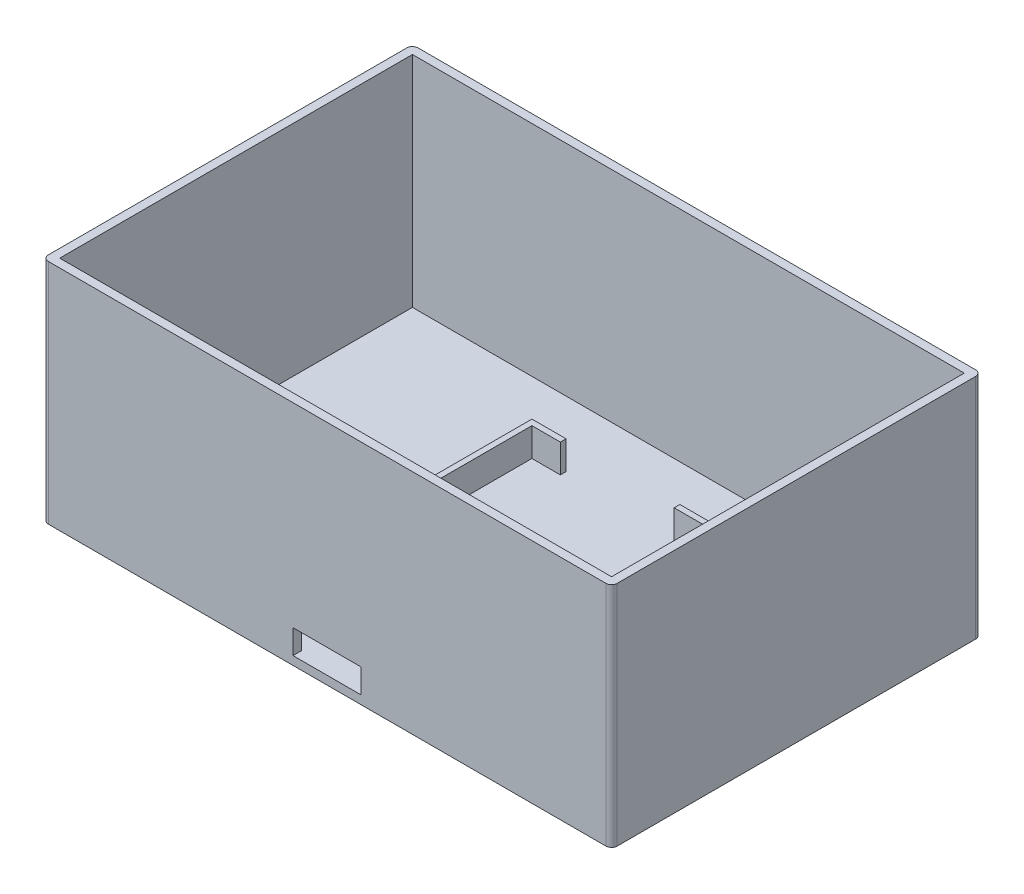
ISO-10303-21;
HEADER;
FILE_DESCRIPTION(('STEP AP214'),'2;1');
FILE_NAME('part.step','',(''),(''),'','','');
FILE_SCHEMA(('AUTOMOTIVE_DESIGN { 1 0 10303 214 1 1 1 1 }'));
ENDSEC;
DATA;
#1=APPLICATION_CONTEXT('core data for automotive mechanical design processes');
#2=APPLICATION_PROTOCOL_DEFINITION('international standard','automotive_design',2000,#1);
#3=PRODUCT_CONTEXT('',#1,'mechanical');
#4=PRODUCT('Part','Part','',(#3));
#5=PRODUCT_RELATED_PRODUCT_CATEGORY('part','',(#4));
#6=PRODUCT_DEFINITION_FORMATION('','',#4);
#7=PRODUCT_DEFINITION_CONTEXT('part definition',#1,'design');
#8=PRODUCT_DEFINITION('design','',#6,#7);
#9=PRODUCT_DEFINITION_SHAPE('','',#8);
#10=(LENGTH_UNIT() NAMED_UNIT(*) SI_UNIT(.MILLI.,.METRE.));
#11=(NAMED_UNIT(*) PLANE_ANGLE_UNIT() SI_UNIT($,.RADIAN.));
#12=(NAMED_UNIT(*) SI_UNIT($,.STERADIAN.) SOLID_ANGLE_UNIT());
#13=UNCERTAINTY_MEASURE_WITH_UNIT(LENGTH_MEASURE(1.E-05),#10,'distance_accuracy_value','');
#14=(GEOMETRIC_REPRESENTATION_CONTEXT(3) GLOBAL_UNCERTAINTY_ASSIGNED_CONTEXT((#13)) GLOBAL_UNIT_ASSIGNED_CONTEXT((#10,
#11,#12)) REPRESENTATION_CONTEXT('',''));
#15=CARTESIAN_POINT('',(0.,0.,0.));
#16=DIRECTION('',(0.,0.,1.));
#17=DIRECTION('',(1.,0.,0.));
#18=AXIS2_PLACEMENT_3D('',#15,#16,#17);
#19=CARTESIAN_POINT('',(-13.7604562737643,6.5,-28.8555133079848));
#20=DIRECTION('',(0.,0.,1.));
#21=DIRECTION('',(1.,0.,0.));
#22=AXIS2_PLACEMENT_3D('',#19,#20,#21);
#23=PLANE('',#22);
#24=DIRECTION('',(0.,1.,0.));
#25=VECTOR('',#24,1.);
#26=CARTESIAN_POINT('',(-8.76045627376426,1.5,-28.8555133079848));
#27=LINE('',#26,#25);
#28=CARTESIAN_POINT('',(-8.76045627376426,1.5,-28.8555133079848));
#29=VERTEX_POINT('',#28);
#30=CARTESIAN_POINT('',(-8.76045627376426,6.5,-28.8555133079848));
#31=VERTEX_POINT('',#30);
#32=EDGE_CURVE('E348',#29,#31,#27,.T.);
#33=ORIENTED_EDGE('',*,*,#32,.T.);
#34=DIRECTION('',(-1.,0.,0.));
#35=VECTOR('',#34,1.);
#36=CARTESIAN_POINT('',(-13.7604562737643,6.5,-28.8555133079848));
#37=LINE('',#36,#35);
#38=CARTESIAN_POINT('',(-13.7604562737643,6.5,-28.8555133079848));
#39=VERTEX_POINT('',#38);
#40=EDGE_CURVE('E342',#31,#39,#37,.T.);
#41=ORIENTED_EDGE('',*,*,#40,.T.);
#42=DIRECTION('',(0.,-1.,0.));
#43=VECTOR('',#42,1.);
#44=CARTESIAN_POINT('',(-13.7604562737643,6.5,-28.8555133079848));
#45=LINE('',#44,#43);
#46=CARTESIAN_POINT('',(-13.7604562737643,1.5,-28.8555133079848));
#47=VERTEX_POINT('',#46);
#48=EDGE_CURVE('E327',#39,#47,#45,.T.);
#49=ORIENTED_EDGE('',*,*,#48,.T.);
#50=DIRECTION('',(-1.,0.,0.));
#51=VECTOR('',#50,1.);
#52=CARTESIAN_POINT('',(-13.7604562737643,1.5,-28.8555133079848));
#53=LINE('',#52,#51);
#54=EDGE_CURVE('E335',#29,#47,#53,.T.);
#55=ORIENTED_EDGE('',*,*,#54,.F.);
#56=EDGE_LOOP('',(#33,#41,#49,#55));
#57=FACE_BOUND('',#56,.T.);
#58=ADVANCED_FACE('F57',(#57),#23,.T.);
#59=CARTESIAN_POINT('',(-13.7604562737643,6.5,-29.8555133079848));
#60=DIRECTION('',(0.,0.,1.));
#61=DIRECTION('',(1.,0.,0.));
#62=AXIS2_PLACEMENT_3D('',#59,#60,#61);
#63=PLANE('',#62);
#64=DIRECTION('',(-1.,0.,0.));
#65=VECTOR('',#64,1.);
#66=CARTESIAN_POINT('',(-13.7604562737643,6.5,-29.8555133079848));
#67=LINE('',#66,#65);
#68=CARTESIAN_POINT('',(-8.76045627376426,6.5,-29.8555133079848));
#69=VERTEX_POINT('',#68);
#70=CARTESIAN_POINT('',(-14.7604562737643,6.5,-29.8555133079848));
#71=VERTEX_POINT('',#70);
#72=EDGE_CURVE('E315',#69,#71,#67,.T.);
#73=ORIENTED_EDGE('',*,*,#72,.F.);
#74=DIRECTION('',(0.,1.,0.));
#75=VECTOR('',#74,1.);
#76=CARTESIAN_POINT('',(-8.76045627376426,1.5,-29.8555133079848));
#77=LINE('',#76,#75);
#78=CARTESIAN_POINT('',(-8.76045627376426,1.5,-29.8555133079848));
#79=VERTEX_POINT('',#78);
#80=EDGE_CURVE('E339',#79,#69,#77,.T.);
#81=ORIENTED_EDGE('',*,*,#80,.F.);
#82=DIRECTION('',(-1.,0.,0.));
#83=VECTOR('',#82,1.);
#84=CARTESIAN_POINT('',(-13.7604562737643,1.5,-29.8555133079848));
#85=LINE('',#84,#83);
#86=CARTESIAN_POINT('',(-14.7604562737643,1.5,-29.8555133079848));
#87=VERTEX_POINT('',#86);
#88=EDGE_CURVE('E308',#79,#87,#85,.T.);
#89=ORIENTED_EDGE('',*,*,#88,.T.);
#90=DIRECTION('',(0.,-1.,0.));
#91=VECTOR('',#90,1.);
#92=CARTESIAN_POINT('',(-14.7604562737643,6.5,-29.8555133079848));
#93=LINE('',#92,#91);
#94=EDGE_CURVE('E300',#71,#87,#93,.T.);
#95=ORIENTED_EDGE('',*,*,#94,.F.);
#96=EDGE_LOOP('',(#73,#81,#89,#95));
#97=FACE_BOUND('',#96,.T.);
#98=ADVANCED_FACE('F533',(#97),#63,.F.);
#99=CARTESIAN_POINT('',(0.,6.5,0.));
#100=DIRECTION('',(0.,1.,0.));
#101=DIRECTION('',(0.,0.,1.));
#102=AXIS2_PLACEMENT_3D('',#99,#100,#101);
#103=PLANE('',#102);
#104=DIRECTION('',(0.,0.,1.));
#105=VECTOR('',#104,1.);
#106=CARTESIAN_POINT('',(-8.76045627376426,6.5,-29.8555133079848));
#107=LINE('',#106,#105);
#108=EDGE_CURVE('E361',#69,#31,#107,.T.);
#109=ORIENTED_EDGE('',*,*,#108,.F.);
#110=ORIENTED_EDGE('',*,*,#72,.T.);
#111=DIRECTION('',(0.,0.,1.));
#112=VECTOR('',#111,1.);
#113=CARTESIAN_POINT('',(-14.7604562737643,6.5,-28.8555133079848));
#114=LINE('',#113,#112);
#115=CARTESIAN_POINT('',(-14.7604562737643,6.5,20.6444866920152));
#116=VERTEX_POINT('',#115);
#117=EDGE_CURVE('E307',#71,#116,#114,.T.);
#118=ORIENTED_EDGE('',*,*,#117,.T.);
#119=DIRECTION('',(-1.,0.,0.));
#120=VECTOR('',#119,1.);
#121=CARTESIAN_POINT('',(-47.2604562737643,6.5,20.6444866920152));
#122=LINE('',#121,#120);
#123=CARTESIAN_POINT('',(-13.7604562737643,6.5,20.6444866920152));
#124=VERTEX_POINT('',#123);
#125=EDGE_CURVE('E289',#124,#116,#122,.T.);
#126=ORIENTED_EDGE('',*,*,#125,.F.);
#127=DIRECTION('',(0.,0.,1.));
#128=VECTOR('',#127,1.);
#129=CARTESIAN_POINT('',(-13.7604562737643,6.5,-28.8555133079848));
#130=LINE('',#129,#128);
#131=EDGE_CURVE('E334',#39,#124,#130,.T.);
#132=ORIENTED_EDGE('',*,*,#131,.F.);
#133=ORIENTED_EDGE('',*,*,#40,.F.);
#134=EDGE_LOOP('',(#109,#110,#118,#126,#132,#133));
#135=FACE_BOUND('',#134,.T.);
#136=ADVANCED_FACE('F539',(#135),#103,.T.);
#137=CARTESIAN_POINT('',(-47.2604562737643,1.5,20.6444866920152));
#138=DIRECTION('',(0.,0.,1.));
#139=DIRECTION('',(1.,0.,0.));
#140=AXIS2_PLACEMENT_3D('',#137,#138,#139);
#141=PLANE('',#140);
#142=DIRECTION('',(1.,0.,0.));
#143=VECTOR('',#142,1.);
#144=CARTESIAN_POINT('',(-4.76045627376426,5.75,20.6444866920152));
#145=LINE('',#144,#143);
#146=CARTESIAN_POINT('',(-4.76045627376426,5.75,20.6444866920152));
#147=VERTEX_POINT('',#146);
#148=CARTESIAN_POINT('',(7.23954372623574,5.75,20.6444866920152));
#149=VERTEX_POINT('',#148);
#150=EDGE_CURVE('E244',#147,#149,#145,.T.);
#151=ORIENTED_EDGE('',*,*,#150,.F.);
#152=DIRECTION('',(0.,-1.,0.));
#153=VECTOR('',#152,1.);
#154=CARTESIAN_POINT('',(-4.76045627376426,1.5,20.6444866920152));
#155=LINE('',#154,#153);
#156=CARTESIAN_POINT('',(-4.76045627376426,1.5,20.6444866920152));
#157=VERTEX_POINT('',#156);
#158=EDGE_CURVE('E77',#147,#157,#155,.T.);
#159=ORIENTED_EDGE('',*,*,#158,.T.);
#160=DIRECTION('',(1.,0.,0.));
#161=VECTOR('',#160,1.);
#162=CARTESIAN_POINT('',(-47.2604562737643,1.5,20.6444866920152));
#163=LINE('',#162,#161);
#164=CARTESIAN_POINT('',(-13.7604562737643,1.5,20.6444866920152));
#165=VERTEX_POINT('',#164);
#166=EDGE_CURVE('E240',#165,#157,#163,.T.);
#167=ORIENTED_EDGE('',*,*,#166,.F.);
#168=DIRECTION('',(0.,-1.,0.));
#169=VECTOR('',#168,1.);
#170=CARTESIAN_POINT('',(-13.7604562737643,6.5,20.6444866920152));
#171=LINE('',#170,#169);
#172=EDGE_CURVE('E312',#124,#165,#171,.T.);
#173=ORIENTED_EDGE('',*,*,#172,.F.);
#174=ORIENTED_EDGE('',*,*,#125,.T.);
#175=DIRECTION('',(0.,1.,0.));
#176=VECTOR('',#175,1.);
#177=CARTESIAN_POINT('',(-14.7604562737643,1.5,20.6444866920152));
#178=LINE('',#177,#176);
#179=CARTESIAN_POINT('',(-14.7604562737643,1.5,20.6444866920152));
#180=VERTEX_POINT('',#179);
#181=EDGE_CURVE('E291',#180,#116,#178,.T.);
#182=ORIENTED_EDGE('',*,*,#181,.F.);
#183=CARTESIAN_POINT('',(-47.2604562737643,1.5,20.6444866920152));
#184=VERTEX_POINT('',#183);
#185=EDGE_CURVE('E262',#184,#180,#163,.T.);
#186=ORIENTED_EDGE('',*,*,#185,.F.);
#187=DIRECTION('',(0.,1.,0.));
#188=VECTOR('',#187,1.);
#189=CARTESIAN_POINT('',(-47.2604562737643,1.5,20.6444866920152));
#190=LINE('',#189,#188);
#191=CARTESIAN_POINT('',(-47.2604562737643,40.,20.6444866920152));
#192=VERTEX_POINT('',#191);
#193=EDGE_CURVE('E418',#184,#192,#190,.T.);
#194=ORIENTED_EDGE('',*,*,#193,.T.);
#195=DIRECTION('',(1.,0.,0.));
#196=VECTOR('',#195,1.);
#197=CARTESIAN_POINT('',(-47.2604562737643,40.,20.6444866920152));
#198=LINE('',#197,#196);
#199=CARTESIAN_POINT('',(49.7395437262358,40.,20.6444866920152));
#200=VERTEX_POINT('',#199);
#201=EDGE_CURVE('E413',#192,#200,#198,.T.);
#202=ORIENTED_EDGE('',*,*,#201,.T.);
#203=DIRECTION('',(0.,1.,0.));
#204=VECTOR('',#203,1.);
#205=CARTESIAN_POINT('',(49.7395437262358,1.5,20.6444866920152));
#206=LINE('',#205,#204);
#207=CARTESIAN_POINT('',(49.7395437262358,1.5,20.6444866920152));
#208=VERTEX_POINT('',#207);
#209=EDGE_CURVE('E409',#208,#200,#206,.T.);
#210=ORIENTED_EDGE('',*,*,#209,.F.);
#211=CARTESIAN_POINT('',(17.2395437262358,1.5,20.6444866920152));
#212=VERTEX_POINT('',#211);
#213=EDGE_CURVE('E265',#212,#208,#163,.T.);
#214=ORIENTED_EDGE('',*,*,#213,.F.);
#215=DIRECTION('',(0.,-1.,0.));
#216=VECTOR('',#215,1.);
#217=CARTESIAN_POINT('',(17.2395437262358,1.5,20.6444866920152));
#218=LINE('',#217,#216);
#219=CARTESIAN_POINT('',(17.2395437262358,6.5,20.6444866920152));
#220=VERTEX_POINT('',#219);
#221=EDGE_CURVE('E294',#220,#212,#218,.T.);
#222=ORIENTED_EDGE('',*,*,#221,.F.);
#223=CARTESIAN_POINT('',(16.2395437262358,6.5,20.6444866920152));
#224=VERTEX_POINT('',#223);
#225=EDGE_CURVE('E288',#220,#224,#122,.T.);
#226=ORIENTED_EDGE('',*,*,#225,.T.);
#227=DIRECTION('',(0.,-1.,0.));
#228=VECTOR('',#227,1.);
#229=CARTESIAN_POINT('',(16.2395437262358,6.5,20.6444866920152));
#230=LINE('',#229,#228);
#231=CARTESIAN_POINT('',(16.2395437262358,1.5,20.6444866920152));
#232=VERTEX_POINT('',#231);
#233=EDGE_CURVE('E321',#224,#232,#230,.T.);
#234=ORIENTED_EDGE('',*,*,#233,.T.);
#235=CARTESIAN_POINT('',(7.23954372623574,1.5,20.6444866920152));
#236=VERTEX_POINT('',#235);
#237=EDGE_CURVE('E263',#236,#232,#163,.T.);
#238=ORIENTED_EDGE('',*,*,#237,.F.);
#239=DIRECTION('',(0.,1.,0.));
#240=VECTOR('',#239,1.);
#241=CARTESIAN_POINT('',(7.23954372623574,1.5,20.6444866920152));
#242=LINE('',#241,#240);
#243=EDGE_CURVE('E246',#236,#149,#242,.T.);
#244=ORIENTED_EDGE('',*,*,#243,.T.);
#245=EDGE_LOOP('',(#151,#159,#167,#173,#174,#182,#186,#194,#202,#210,#214,#222,#226,#234,#238,#244));
#246=FACE_BOUND('',#245,.T.);
#247=ADVANCED_FACE('F238',(#246),#141,.F.);
#248=CARTESIAN_POINT('',(0.,40.,0.));
#249=DIRECTION('',(0.,1.,0.));
#250=DIRECTION('',(0.,0.,1.));
#251=AXIS2_PLACEMENT_3D('',#248,#249,#250);
#252=PLANE('',#251);
#253=DIRECTION('',(0.,0.,1.));
#254=VECTOR('',#253,1.);
#255=CARTESIAN_POINT('',(-47.2604562737643,40.,-41.3555133079848));
#256=LINE('',#255,#254);
#257=CARTESIAN_POINT('',(-47.2604562737643,40.,-41.3555133079848));
#258=VERTEX_POINT('',#257);
#259=EDGE_CURVE('E284',#258,#192,#256,.T.);
#260=ORIENTED_EDGE('',*,*,#259,.F.);
#261=DIRECTION('',(-1.,0.,0.));
#262=VECTOR('',#261,1.);
#263=CARTESIAN_POINT('',(-47.2604562737643,40.,-41.3555133079848));
#264=LINE('',#263,#262);
#265=CARTESIAN_POINT('',(49.7395437262358,40.,-41.3555133079848));
#266=VERTEX_POINT('',#265);
#267=EDGE_CURVE('E275',#266,#258,#264,.T.);
#268=ORIENTED_EDGE('',*,*,#267,.F.);
#269=DIRECTION('',(0.,0.,-1.));
#270=VECTOR('',#269,1.);
#271=CARTESIAN_POINT('',(49.7395437262358,40.,-41.3555133079848));
#272=LINE('',#271,#270);
#273=EDGE_CURVE('E279',#200,#266,#272,.T.);
#274=ORIENTED_EDGE('',*,*,#273,.F.);
#275=ORIENTED_EDGE('',*,*,#201,.F.);
#276=EDGE_LOOP('',(#260,#268,#274,#275));
#277=FACE_BOUND('',#276,.T.);
#278=DIRECTION('',(-1.,0.,0.));
#279=VECTOR('',#278,1.);
#280=CARTESIAN_POINT('',(-48.7604562737643,40.,-42.8555133079848));
#281=LINE('',#280,#279);
#282=CARTESIAN_POINT('',(50.2395437262357,40.,-42.8555133079848));
#283=VERTEX_POINT('',#282);
#284=CARTESIAN_POINT('',(-47.7604562737643,40.,-42.8555133079848));
#285=VERTEX_POINT('',#284);
#286=EDGE_CURVE('E430',#283,#285,#281,.T.);
#287=ORIENTED_EDGE('',*,*,#286,.T.);
#288=CARTESIAN_POINT('',(-47.7604562737643,40.,-41.8555133079848));
#289=DIRECTION('',(0.,1.,0.));
#290=DIRECTION('',(0.,0.,1.));
#291=AXIS2_PLACEMENT_3D('',#288,#289,#290);
#292=CIRCLE('',#291,1.);
#293=CARTESIAN_POINT('',(-48.7604562737643,40.,-41.8555133079848));
#294=VERTEX_POINT('',#293);
#295=EDGE_CURVE('E480',#285,#294,#292,.T.);
#296=ORIENTED_EDGE('',*,*,#295,.T.);
#297=DIRECTION('',(0.,0.,1.));
#298=VECTOR('',#297,1.);
#299=CARTESIAN_POINT('',(-48.7604562737643,40.,-42.8555133079848));
#300=LINE('',#299,#298);
#301=CARTESIAN_POINT('',(-48.7604562737643,40.,21.1444866920152));
#302=VERTEX_POINT('',#301);
#303=EDGE_CURVE('E437',#294,#302,#300,.T.);
#304=ORIENTED_EDGE('',*,*,#303,.T.);
#305=CARTESIAN_POINT('',(-47.7604562737643,40.,21.1444866920152));
#306=DIRECTION('',(0.,1.,0.));
#307=DIRECTION('',(0.,0.,1.));
#308=AXIS2_PLACEMENT_3D('',#305,#306,#307);
#309=CIRCLE('',#308,1.);
#310=CARTESIAN_POINT('',(-47.7604562737643,40.,22.1444866920152));
#311=VERTEX_POINT('',#310);
#312=EDGE_CURVE('E474',#302,#311,#309,.T.);
#313=ORIENTED_EDGE('',*,*,#312,.T.);
#314=DIRECTION('',(1.,0.,0.));
#315=VECTOR('',#314,1.);
#316=CARTESIAN_POINT('',(-48.7604562737643,40.,22.1444866920152));
#317=LINE('',#316,#315);
#318=CARTESIAN_POINT('',(50.2395437262358,40.,22.1444866920152));
#319=VERTEX_POINT('',#318);
#320=EDGE_CURVE('E448',#311,#319,#317,.T.);
#321=ORIENTED_EDGE('',*,*,#320,.T.);
#322=CARTESIAN_POINT('',(50.2395437262358,40.,21.1444866920152));
#323=DIRECTION('',(0.,1.,0.));
#324=DIRECTION('',(0.,0.,1.));
#325=AXIS2_PLACEMENT_3D('',#322,#323,#324);
#326=CIRCLE('',#325,1.);
#327=CARTESIAN_POINT('',(51.2395437262358,40.,21.1444866920152));
#328=VERTEX_POINT('',#327);
#329=EDGE_CURVE('E476',#319,#328,#326,.T.);
#330=ORIENTED_EDGE('',*,*,#329,.T.);
#331=DIRECTION('',(0.,0.,-1.));
#332=VECTOR('',#331,1.);
#333=CARTESIAN_POINT('',(51.2395437262357,40.,-42.8555133079848));
#334=LINE('',#333,#332);
#335=CARTESIAN_POINT('',(51.2395437262357,40.,-41.8555133079848));
#336=VERTEX_POINT('',#335);
#337=EDGE_CURVE('E451',#328,#336,#334,.T.);
#338=ORIENTED_EDGE('',*,*,#337,.T.);
#339=CARTESIAN_POINT('',(50.2395437262357,40.,-41.8555133079848));
#340=DIRECTION('',(0.,1.,0.));
#341=DIRECTION('',(0.,0.,1.));
#342=AXIS2_PLACEMENT_3D('',#339,#340,#341);
#343=CIRCLE('',#342,1.);
#344=EDGE_CURVE('E478',#336,#283,#343,.T.);
#345=ORIENTED_EDGE('',*,*,#344,.T.);
#346=EDGE_LOOP('',(#287,#296,#304,#313,#321,#330,#338,#345));
#347=FACE_BOUND('',#346,.T.);
#348=ADVANCED_FACE('F496',(#277,#347),#252,.T.);
#349=CARTESIAN_POINT('',(-48.7604562737643,80.,-42.8555133079848));
#350=DIRECTION('',(1.,0.,0.));
#351=DIRECTION('',(0.,0.,-1.));
#352=AXIS2_PLACEMENT_3D('',#349,#350,#351);
#353=PLANE('',#352);
#354=ORIENTED_EDGE('',*,*,#303,.F.);
#355=DIRECTION('',(0.,-1.,0.));
#356=VECTOR('',#355,1.);
#357=CARTESIAN_POINT('',(-48.7604562737643,80.,-41.8555133079848));
#358=LINE('',#357,#356);
#359=CARTESIAN_POINT('',(-48.7604562737643,0.,-41.8555133079848));
#360=VERTEX_POINT('',#359);
#361=EDGE_CURVE('E458',#294,#360,#358,.T.);
#362=ORIENTED_EDGE('',*,*,#361,.T.);
#363=DIRECTION('',(0.,0.,1.));
#364=VECTOR('',#363,1.);
#365=CARTESIAN_POINT('',(-48.7604562737643,0.,-42.8555133079848));
#366=LINE('',#365,#364);
#367=CARTESIAN_POINT('',(-48.7604562737643,0.,21.1444866920152));
#368=VERTEX_POINT('',#367);
#369=EDGE_CURVE('E443',#360,#368,#366,.T.);
#370=ORIENTED_EDGE('',*,*,#369,.T.);
#371=DIRECTION('',(0.,-1.,0.));
#372=VECTOR('',#371,1.);
#373=CARTESIAN_POINT('',(-48.7604562737643,80.,21.1444866920152));
#374=LINE('',#373,#372);
#375=EDGE_CURVE('E245',#368,#302,#374,.F.);
#376=ORIENTED_EDGE('',*,*,#375,.T.);
#377=EDGE_LOOP('',(#354,#362,#370,#376));
#378=FACE_BOUND('',#377,.T.);
#379=ADVANCED_FACE('F523',(#378),#353,.F.);
#380=CARTESIAN_POINT('',(-48.7604562737643,80.,22.1444866920152));
#381=DIRECTION('',(0.,0.,-1.));
#382=DIRECTION('',(-1.,0.,0.));
#383=AXIS2_PLACEMENT_3D('',#380,#381,#382);
#384=PLANE('',#383);
#385=DIRECTION('',(0.,-1.,0.));
#386=VECTOR('',#385,1.);
#387=CARTESIAN_POINT('',(-4.76045627376426,2.,22.1444866920152));
#388=LINE('',#387,#386);
#389=CARTESIAN_POINT('',(-4.76045627376426,5.75,22.1444866920152));
#390=VERTEX_POINT('',#389);
#391=CARTESIAN_POINT('',(-4.76045627376426,1.5,22.1444866920152));
#392=VERTEX_POINT('',#391);
#393=EDGE_CURVE('E251',#390,#392,#388,.T.);
#394=ORIENTED_EDGE('',*,*,#393,.F.);
#395=DIRECTION('',(1.,0.,0.));
#396=VECTOR('',#395,1.);
#397=CARTESIAN_POINT('',(-4.76045627376426,5.75,22.1444866920152));
#398=LINE('',#397,#396);
#399=CARTESIAN_POINT('',(7.23954372623574,5.75,22.1444866920152));
#400=VERTEX_POINT('',#399);
#401=EDGE_CURVE('E371',#390,#400,#398,.T.);
#402=ORIENTED_EDGE('',*,*,#401,.T.);
#403=DIRECTION('',(0.,1.,0.));
#404=VECTOR('',#403,1.);
#405=CARTESIAN_POINT('',(7.23954372623574,2.,22.1444866920152));
#406=LINE('',#405,#404);
#407=CARTESIAN_POINT('',(7.23954372623574,1.5,22.1444866920152));
#408=VERTEX_POINT('',#407);
#409=EDGE_CURVE('E282',#408,#400,#406,.T.);
#410=ORIENTED_EDGE('',*,*,#409,.F.);
#411=DIRECTION('',(1.,0.,0.));
#412=VECTOR('',#411,1.);
#413=CARTESIAN_POINT('',(-4.76045627376426,1.5,22.1444866920152));
#414=LINE('',#413,#412);
#415=EDGE_CURVE('E256',#392,#408,#414,.T.);
#416=ORIENTED_EDGE('',*,*,#415,.F.);
#417=EDGE_LOOP('',(#394,#402,#410,#416));
#418=FACE_BOUND('',#417,.T.);
#419=DIRECTION('',(1.,0.,0.));
#420=VECTOR('',#419,1.);
#421=CARTESIAN_POINT('',(-48.7604562737643,0.,22.1444866920152));
#422=LINE('',#421,#420);
#423=CARTESIAN_POINT('',(-47.7604562737643,0.,22.1444866920152));
#424=VERTEX_POINT('',#423);
#425=CARTESIAN_POINT('',(50.2395437262358,0.,22.1444866920152));
#426=VERTEX_POINT('',#425);
#427=EDGE_CURVE('E440',#424,#426,#422,.T.);
#428=ORIENTED_EDGE('',*,*,#427,.T.);
#429=DIRECTION('',(0.,-1.,0.));
#430=VECTOR('',#429,1.);
#431=CARTESIAN_POINT('',(50.2395437262358,80.,22.1444866920152));
#432=LINE('',#431,#430);
#433=EDGE_CURVE('E65',#426,#319,#432,.F.);
#434=ORIENTED_EDGE('',*,*,#433,.T.);
#435=ORIENTED_EDGE('',*,*,#320,.F.);
#436=DIRECTION('',(0.,-1.,0.));
#437=VECTOR('',#436,1.);
#438=CARTESIAN_POINT('',(-47.7604562737643,80.,22.1444866920152));
#439=LINE('',#438,#437);
#440=EDGE_CURVE('E487',#311,#424,#439,.T.);
#441=ORIENTED_EDGE('',*,*,#440,.T.);
#442=EDGE_LOOP('',(#428,#434,#435,#441));
#443=FACE_BOUND('',#442,.T.);
#444=ADVANCED_FACE('F379',(#418,#443),#384,.F.);
#445=CARTESIAN_POINT('',(51.2395437262357,80.,-42.8555133079848));
#446=DIRECTION('',(-1.,0.,0.));
#447=DIRECTION('',(0.,0.,1.));
#448=AXIS2_PLACEMENT_3D('',#445,#446,#447);
#449=PLANE('',#448);
#450=DIRECTION('',(0.,0.,-1.));
#451=VECTOR('',#450,1.);
#452=CARTESIAN_POINT('',(51.2395437262357,0.,-42.8555133079848));
#453=LINE('',#452,#451);
#454=CARTESIAN_POINT('',(51.2395437262358,0.,21.1444866920152));
#455=VERTEX_POINT('',#454);
#456=CARTESIAN_POINT('',(51.2395437262357,0.,-41.8555133079848));
#457=VERTEX_POINT('',#456);
#458=EDGE_CURVE('E436',#455,#457,#453,.T.);
#459=ORIENTED_EDGE('',*,*,#458,.T.);
#460=DIRECTION('',(0.,-1.,0.));
#461=VECTOR('',#460,1.);
#462=CARTESIAN_POINT('',(51.2395437262357,80.,-41.8555133079848));
#463=LINE('',#462,#461);
#464=EDGE_CURVE('E485',#457,#336,#463,.F.);
#465=ORIENTED_EDGE('',*,*,#464,.T.);
#466=ORIENTED_EDGE('',*,*,#337,.F.);
#467=DIRECTION('',(0.,-1.,0.));
#468=VECTOR('',#467,1.);
#469=CARTESIAN_POINT('',(51.2395437262358,80.,21.1444866920152));
#470=LINE('',#469,#468);
#471=EDGE_CURVE('E482',#328,#455,#470,.T.);
#472=ORIENTED_EDGE('',*,*,#471,.T.);
#473=EDGE_LOOP('',(#459,#465,#466,#472));
#474=FACE_BOUND('',#473,.T.);
#475=ADVANCED_FACE('F503',(#474),#449,.F.);
#476=CARTESIAN_POINT('',(-48.7604562737643,80.,-42.8555133079848));
#477=DIRECTION('',(0.,0.,1.));
#478=DIRECTION('',(1.,0.,0.));
#479=AXIS2_PLACEMENT_3D('',#476,#477,#478);
#480=PLANE('',#479);
#481=DIRECTION('',(-1.,0.,0.));
#482=VECTOR('',#481,1.);
#483=CARTESIAN_POINT('',(-48.7604562737643,0.,-42.8555133079848));
#484=LINE('',#483,#482);
#485=CARTESIAN_POINT('',(50.2395437262357,0.,-42.8555133079848));
#486=VERTEX_POINT('',#485);
#487=CARTESIAN_POINT('',(-47.7604562737643,0.,-42.8555133079848));
#488=VERTEX_POINT('',#487);
#489=EDGE_CURVE('E433',#486,#488,#484,.T.);
#490=ORIENTED_EDGE('',*,*,#489,.T.);
#491=DIRECTION('',(0.,-1.,0.));
#492=VECTOR('',#491,1.);
#493=CARTESIAN_POINT('',(-47.7604562737643,80.,-42.8555133079848));
#494=LINE('',#493,#492);
#495=EDGE_CURVE('E472',#488,#285,#494,.F.);
#496=ORIENTED_EDGE('',*,*,#495,.T.);
#497=ORIENTED_EDGE('',*,*,#286,.F.);
#498=DIRECTION('',(0.,-1.,0.));
#499=VECTOR('',#498,1.);
#500=CARTESIAN_POINT('',(50.2395437262357,80.,-42.8555133079848));
#501=LINE('',#500,#499);
#502=EDGE_CURVE('E469',#283,#486,#501,.T.);
#503=ORIENTED_EDGE('',*,*,#502,.T.);
#504=EDGE_LOOP('',(#490,#496,#497,#503));
#505=FACE_BOUND('',#504,.T.);
#506=ADVANCED_FACE('F515',(#505),#480,.F.);
#507=CARTESIAN_POINT('',(0.,0.,0.));
#508=DIRECTION('',(0.,1.,0.));
#509=DIRECTION('',(0.,0.,1.));
#510=AXIS2_PLACEMENT_3D('',#507,#508,#509);
#511=PLANE('',#510);
#512=ORIENTED_EDGE('',*,*,#369,.F.);
#513=CARTESIAN_POINT('',(-47.7604562737643,0.,-41.8555133079848));
#514=DIRECTION('',(0.,1.,0.));
#515=DIRECTION('',(0.,0.,1.));
#516=AXIS2_PLACEMENT_3D('',#513,#514,#515);
#517=CIRCLE('',#516,1.);
#518=EDGE_CURVE('E467',#360,#488,#517,.F.);
#519=ORIENTED_EDGE('',*,*,#518,.T.);
#520=ORIENTED_EDGE('',*,*,#489,.F.);
#521=CARTESIAN_POINT('',(50.2395437262357,0.,-41.8555133079848));
#522=DIRECTION('',(0.,1.,0.));
#523=DIRECTION('',(0.,0.,1.));
#524=AXIS2_PLACEMENT_3D('',#521,#522,#523);
#525=CIRCLE('',#524,1.);
#526=EDGE_CURVE('E465',#486,#457,#525,.F.);
#527=ORIENTED_EDGE('',*,*,#526,.T.);
#528=ORIENTED_EDGE('',*,*,#458,.F.);
#529=CARTESIAN_POINT('',(50.2395437262358,0.,21.1444866920152));
#530=DIRECTION('',(0.,1.,0.));
#531=DIRECTION('',(0.,0.,1.));
#532=AXIS2_PLACEMENT_3D('',#529,#530,#531);
#533=CIRCLE('',#532,1.);
#534=EDGE_CURVE('E463',#455,#426,#533,.F.);
#535=ORIENTED_EDGE('',*,*,#534,.T.);
#536=ORIENTED_EDGE('',*,*,#427,.F.);
#537=CARTESIAN_POINT('',(-47.7604562737643,0.,21.1444866920152));
#538=DIRECTION('',(0.,1.,0.));
#539=DIRECTION('',(0.,0.,1.));
#540=AXIS2_PLACEMENT_3D('',#537,#538,#539);
#541=CIRCLE('',#540,1.);
#542=EDGE_CURVE('E461',#424,#368,#541,.F.);
#543=ORIENTED_EDGE('',*,*,#542,.T.);
#544=EDGE_LOOP('',(#512,#519,#520,#527,#528,#535,#536,#543));
#545=FACE_BOUND('',#544,.T.);
#546=ADVANCED_FACE('F507',(#545),#511,.F.);
#547=CARTESIAN_POINT('',(-47.2604562737643,1.5,-41.3555133079848));
#548=DIRECTION('',(-1.,0.,0.));
#549=DIRECTION('',(0.,0.,1.));
#550=AXIS2_PLACEMENT_3D('',#547,#548,#549);
#551=PLANE('',#550);
#552=ORIENTED_EDGE('',*,*,#259,.T.);
#553=ORIENTED_EDGE('',*,*,#193,.F.);
#554=DIRECTION('',(0.,0.,1.));
#555=VECTOR('',#554,1.);
#556=CARTESIAN_POINT('',(-47.2604562737643,1.5,-41.3555133079848));
#557=LINE('',#556,#555);
#558=CARTESIAN_POINT('',(-47.2604562737643,1.5,-41.3555133079848));
#559=VERTEX_POINT('',#558);
#560=EDGE_CURVE('E270',#559,#184,#557,.T.);
#561=ORIENTED_EDGE('',*,*,#560,.F.);
#562=DIRECTION('',(0.,1.,0.));
#563=VECTOR('',#562,1.);
#564=CARTESIAN_POINT('',(-47.2604562737643,1.5,-41.3555133079848));
#565=LINE('',#564,#563);
#566=EDGE_CURVE('E428',#559,#258,#565,.T.);
#567=ORIENTED_EDGE('',*,*,#566,.T.);
#568=EDGE_LOOP('',(#552,#553,#561,#567));
#569=FACE_BOUND('',#568,.T.);
#570=ADVANCED_FACE('F573',(#569),#551,.F.);
#571=CARTESIAN_POINT('',(-47.2604562737643,1.5,-41.3555133079848));
#572=DIRECTION('',(0.,0.,-1.));
#573=DIRECTION('',(-1.,0.,0.));
#574=AXIS2_PLACEMENT_3D('',#571,#572,#573);
#575=PLANE('',#574);
#576=ORIENTED_EDGE('',*,*,#267,.T.);
#577=ORIENTED_EDGE('',*,*,#566,.F.);
#578=DIRECTION('',(-1.,0.,0.));
#579=VECTOR('',#578,1.);
#580=CARTESIAN_POINT('',(-47.2604562737643,1.5,-41.3555133079848));
#581=LINE('',#580,#579);
#582=CARTESIAN_POINT('',(49.7395437262358,1.5,-41.3555133079848));
#583=VERTEX_POINT('',#582);
#584=EDGE_CURVE('E422',#583,#559,#581,.T.);
#585=ORIENTED_EDGE('',*,*,#584,.F.);
#586=DIRECTION('',(0.,1.,0.));
#587=VECTOR('',#586,1.);
#588=CARTESIAN_POINT('',(49.7395437262358,1.5,-41.3555133079848));
#589=LINE('',#588,#587);
#590=EDGE_CURVE('E417',#583,#266,#589,.T.);
#591=ORIENTED_EDGE('',*,*,#590,.T.);
#592=EDGE_LOOP('',(#576,#577,#585,#591));
#593=FACE_BOUND('',#592,.T.);
#594=ADVANCED_FACE('F570',(#593),#575,.F.);
#595=CARTESIAN_POINT('',(49.7395437262358,1.5,-41.3555133079848));
#596=DIRECTION('',(1.,0.,0.));
#597=DIRECTION('',(0.,0.,-1.));
#598=AXIS2_PLACEMENT_3D('',#595,#596,#597);
#599=PLANE('',#598);
#600=ORIENTED_EDGE('',*,*,#273,.T.);
#601=ORIENTED_EDGE('',*,*,#590,.F.);
#602=DIRECTION('',(0.,0.,-1.));
#603=VECTOR('',#602,1.);
#604=CARTESIAN_POINT('',(49.7395437262358,1.5,-41.3555133079848));
#605=LINE('',#604,#603);
#606=EDGE_CURVE('E267',#208,#583,#605,.T.);
#607=ORIENTED_EDGE('',*,*,#606,.F.);
#608=ORIENTED_EDGE('',*,*,#209,.T.);
#609=EDGE_LOOP('',(#600,#601,#607,#608));
#610=FACE_BOUND('',#609,.T.);
#611=ADVANCED_FACE('F420',(#610),#599,.F.);
#612=CARTESIAN_POINT('',(-4.76045627376426,2.,17.1444866920152));
#613=DIRECTION('',(-1.,0.,0.));
#614=DIRECTION('',(0.,0.,1.));
#615=AXIS2_PLACEMENT_3D('',#612,#613,#614);
#616=PLANE('',#615);
#617=ORIENTED_EDGE('',*,*,#158,.F.);
#618=DIRECTION('',(0.,0.,1.));
#619=VECTOR('',#618,1.);
#620=CARTESIAN_POINT('',(-4.76045627376426,5.75,20.6444866920152));
#621=LINE('',#620,#619);
#622=EDGE_CURVE('E72',#147,#390,#621,.T.);
#623=ORIENTED_EDGE('',*,*,#622,.T.);
#624=ORIENTED_EDGE('',*,*,#393,.T.);
#625=DIRECTION('',(0.,0.,1.));
#626=VECTOR('',#625,1.);
#627=CARTESIAN_POINT('',(-4.76045627376426,1.5,-8.85551330798478));
#628=LINE('',#627,#626);
#629=EDGE_CURVE('E249',#157,#392,#628,.T.);
#630=ORIENTED_EDGE('',*,*,#629,.F.);
#631=EDGE_LOOP('',(#617,#623,#624,#630));
#632=FACE_BOUND('',#631,.T.);
#633=ADVANCED_FACE('F250',(#632),#616,.F.);
#634=CARTESIAN_POINT('',(7.23954372623574,2.,17.1444866920152));
#635=DIRECTION('',(1.,0.,0.));
#636=DIRECTION('',(0.,0.,-1.));
#637=AXIS2_PLACEMENT_3D('',#634,#635,#636);
#638=PLANE('',#637);
#639=ORIENTED_EDGE('',*,*,#409,.T.);
#640=DIRECTION('',(0.,0.,1.));
#641=VECTOR('',#640,1.);
#642=CARTESIAN_POINT('',(7.23954372623574,5.75,20.6444866920152));
#643=LINE('',#642,#641);
#644=EDGE_CURVE('E363',#149,#400,#643,.T.);
#645=ORIENTED_EDGE('',*,*,#644,.F.);
#646=ORIENTED_EDGE('',*,*,#243,.F.);
#647=DIRECTION('',(0.,0.,1.));
#648=VECTOR('',#647,1.);
#649=CARTESIAN_POINT('',(7.23954372623574,1.5,-8.85551330798478));
#650=LINE('',#649,#648);
#651=EDGE_CURVE('E255',#236,#408,#650,.T.);
#652=ORIENTED_EDGE('',*,*,#651,.T.);
#653=EDGE_LOOP('',(#639,#645,#646,#652));
#654=FACE_BOUND('',#653,.T.);
#655=ADVANCED_FACE('F565',(#654),#638,.F.);
#656=CARTESIAN_POINT('',(-47.7604562737643,80.,-41.8555133079848));
#657=DIRECTION('',(0.,-1.,0.));
#658=DIRECTION('',(0.,0.,-1.));
#659=AXIS2_PLACEMENT_3D('',#656,#657,#658);
#660=CYLINDRICAL_SURFACE('',#659,1.);
#661=ORIENTED_EDGE('',*,*,#295,.F.);
#662=ORIENTED_EDGE('',*,*,#495,.F.);
#663=ORIENTED_EDGE('',*,*,#518,.F.);
#664=ORIENTED_EDGE('',*,*,#361,.F.);
#665=EDGE_LOOP('',(#661,#662,#663,#664));
#666=FACE_BOUND('',#665,.T.);
#667=ADVANCED_FACE('F521',(#666),#660,.T.);
#668=CARTESIAN_POINT('',(50.2395437262357,80.,-41.8555133079848));
#669=DIRECTION('',(0.,-1.,0.));
#670=DIRECTION('',(0.,0.,-1.));
#671=AXIS2_PLACEMENT_3D('',#668,#669,#670);
#672=CYLINDRICAL_SURFACE('',#671,1.);
#673=ORIENTED_EDGE('',*,*,#344,.F.);
#674=ORIENTED_EDGE('',*,*,#464,.F.);
#675=ORIENTED_EDGE('',*,*,#526,.F.);
#676=ORIENTED_EDGE('',*,*,#502,.F.);
#677=EDGE_LOOP('',(#673,#674,#675,#676));
#678=FACE_BOUND('',#677,.T.);
#679=ADVANCED_FACE('F512',(#678),#672,.T.);
#680=CARTESIAN_POINT('',(50.2395437262358,80.,21.1444866920152));
#681=DIRECTION('',(0.,-1.,0.));
#682=DIRECTION('',(0.,0.,-1.));
#683=AXIS2_PLACEMENT_3D('',#680,#681,#682);
#684=CYLINDRICAL_SURFACE('',#683,1.);
#685=ORIENTED_EDGE('',*,*,#329,.F.);
#686=ORIENTED_EDGE('',*,*,#433,.F.);
#687=ORIENTED_EDGE('',*,*,#534,.F.);
#688=ORIENTED_EDGE('',*,*,#471,.F.);
#689=EDGE_LOOP('',(#685,#686,#687,#688));
#690=FACE_BOUND('',#689,.T.);
#691=ADVANCED_FACE('F500',(#690),#684,.T.);
#692=CARTESIAN_POINT('',(-47.7604562737643,80.,21.1444866920152));
#693=DIRECTION('',(0.,-1.,0.));
#694=DIRECTION('',(0.,0.,-1.));
#695=AXIS2_PLACEMENT_3D('',#692,#693,#694);
#696=CYLINDRICAL_SURFACE('',#695,1.);
#697=ORIENTED_EDGE('',*,*,#312,.F.);
#698=ORIENTED_EDGE('',*,*,#375,.F.);
#699=ORIENTED_EDGE('',*,*,#542,.F.);
#700=ORIENTED_EDGE('',*,*,#440,.F.);
#701=EDGE_LOOP('',(#697,#698,#699,#700));
#702=FACE_BOUND('',#701,.T.);
#703=ADVANCED_FACE('F59',(#702),#696,.T.);
#704=CARTESIAN_POINT('',(0.,1.5,0.));
#705=DIRECTION('',(0.,1.,0.));
#706=DIRECTION('',(0.,0.,1.));
#707=AXIS2_PLACEMENT_3D('',#704,#705,#706);
#708=PLANE('',#707);
#709=ORIENTED_EDGE('',*,*,#166,.T.);
#710=ORIENTED_EDGE('',*,*,#629,.T.);
#711=ORIENTED_EDGE('',*,*,#415,.T.);
#712=ORIENTED_EDGE('',*,*,#651,.F.);
#713=ORIENTED_EDGE('',*,*,#237,.T.);
#714=DIRECTION('',(0.,0.,-1.));
#715=VECTOR('',#714,1.);
#716=CARTESIAN_POINT('',(16.2395437262358,1.5,-28.8555133079848));
#717=LINE('',#716,#715);
#718=CARTESIAN_POINT('',(16.2395437262358,1.5,-28.8555133079848));
#719=VERTEX_POINT('',#718);
#720=EDGE_CURVE('E336',#232,#719,#717,.T.);
#721=ORIENTED_EDGE('',*,*,#720,.T.);
#722=CARTESIAN_POINT('',(11.2395437262358,1.5,-28.8555133079848));
#723=VERTEX_POINT('',#722);
#724=EDGE_CURVE('E331',#719,#723,#53,.T.);
#725=ORIENTED_EDGE('',*,*,#724,.T.);
#726=DIRECTION('',(0.,0.,-1.));
#727=VECTOR('',#726,1.);
#728=CARTESIAN_POINT('',(11.2395437262358,1.5,-29.8555133079848));
#729=LINE('',#728,#727);
#730=CARTESIAN_POINT('',(11.2395437262358,1.5,-29.8555133079848));
#731=VERTEX_POINT('',#730);
#732=EDGE_CURVE('E352',#723,#731,#729,.T.);
#733=ORIENTED_EDGE('',*,*,#732,.T.);
#734=CARTESIAN_POINT('',(17.2395437262358,1.5,-29.8555133079848));
#735=VERTEX_POINT('',#734);
#736=EDGE_CURVE('E304',#735,#731,#85,.T.);
#737=ORIENTED_EDGE('',*,*,#736,.F.);
#738=DIRECTION('',(0.,0.,1.));
#739=VECTOR('',#738,1.);
#740=CARTESIAN_POINT('',(17.2395437262358,1.5,0.));
#741=LINE('',#740,#739);
#742=EDGE_CURVE('E12',#735,#212,#741,.T.);
#743=ORIENTED_EDGE('',*,*,#742,.T.);
#744=ORIENTED_EDGE('',*,*,#213,.T.);
#745=ORIENTED_EDGE('',*,*,#606,.T.);
#746=ORIENTED_EDGE('',*,*,#584,.T.);
#747=ORIENTED_EDGE('',*,*,#560,.T.);
#748=ORIENTED_EDGE('',*,*,#185,.T.);
#749=DIRECTION('',(0.,0.,1.));
#750=VECTOR('',#749,1.);
#751=CARTESIAN_POINT('',(-14.7604562737643,1.5,-28.8555133079848));
#752=LINE('',#751,#750);
#753=EDGE_CURVE('E309',#87,#180,#752,.T.);
#754=ORIENTED_EDGE('',*,*,#753,.F.);
#755=ORIENTED_EDGE('',*,*,#88,.F.);
#756=DIRECTION('',(0.,0.,1.));
#757=VECTOR('',#756,1.);
#758=CARTESIAN_POINT('',(-8.76045627376426,1.5,-29.8555133079848));
#759=LINE('',#758,#757);
#760=EDGE_CURVE('E360',#79,#29,#759,.T.);
#761=ORIENTED_EDGE('',*,*,#760,.T.);
#762=ORIENTED_EDGE('',*,*,#54,.T.);
#763=DIRECTION('',(0.,0.,1.));
#764=VECTOR('',#763,1.);
#765=CARTESIAN_POINT('',(-13.7604562737643,1.5,-28.8555133079848));
#766=LINE('',#765,#764);
#767=EDGE_CURVE('E260',#47,#165,#766,.T.);
#768=ORIENTED_EDGE('',*,*,#767,.T.);
#769=EDGE_LOOP('',(#709,#710,#711,#712,#713,#721,#725,#733,#737,#743,#744,#745,#746,#747,#748,
#754,#755,#761,#762,#768));
#770=FACE_BOUND('',#769,.T.);
#771=ADVANCED_FACE('F258',(#770),#708,.T.);
#772=DIRECTION('',(0.,1.,0.));
#773=VECTOR('',#772,1.);
#774=CARTESIAN_POINT('',(11.2395437262358,1.5,-28.8555133079848));
#775=LINE('',#774,#773);
#776=CARTESIAN_POINT('',(11.2395437262358,6.5,-28.8555133079848));
#777=VERTEX_POINT('',#776);
#778=EDGE_CURVE('E351',#723,#777,#775,.T.);
#779=ORIENTED_EDGE('',*,*,#778,.F.);
#780=ORIENTED_EDGE('',*,*,#724,.F.);
#781=DIRECTION('',(0.,-1.,0.));
#782=VECTOR('',#781,1.);
#783=CARTESIAN_POINT('',(16.2395437262358,6.5,-28.8555133079848));
#784=LINE('',#783,#782);
#785=CARTESIAN_POINT('',(16.2395437262358,6.5,-28.8555133079848));
#786=VERTEX_POINT('',#785);
#787=EDGE_CURVE('E324',#786,#719,#784,.T.);
#788=ORIENTED_EDGE('',*,*,#787,.F.);
#789=EDGE_CURVE('E330',#786,#777,#37,.T.);
#790=ORIENTED_EDGE('',*,*,#789,.T.);
#791=EDGE_LOOP('',(#779,#780,#788,#790));
#792=FACE_BOUND('',#791,.T.);
#793=ADVANCED_FACE('F393',(#792),#23,.T.);
#794=CARTESIAN_POINT('',(16.2395437262358,6.5,-28.8555133079848));
#795=DIRECTION('',(-1.,0.,0.));
#796=DIRECTION('',(0.,0.,1.));
#797=AXIS2_PLACEMENT_3D('',#794,#795,#796);
#798=PLANE('',#797);
#799=ORIENTED_EDGE('',*,*,#720,.F.);
#800=ORIENTED_EDGE('',*,*,#233,.F.);
#801=DIRECTION('',(0.,0.,-1.));
#802=VECTOR('',#801,1.);
#803=CARTESIAN_POINT('',(16.2395437262358,6.5,-28.8555133079848));
#804=LINE('',#803,#802);
#805=EDGE_CURVE('E343',#224,#786,#804,.T.);
#806=ORIENTED_EDGE('',*,*,#805,.T.);
#807=ORIENTED_EDGE('',*,*,#787,.T.);
#808=EDGE_LOOP('',(#799,#800,#806,#807));
#809=FACE_BOUND('',#808,.T.);
#810=ADVANCED_FACE('F389',(#809),#798,.T.);
#811=CARTESIAN_POINT('',(-13.7604562737643,6.5,-28.8555133079848));
#812=DIRECTION('',(1.,0.,0.));
#813=DIRECTION('',(0.,0.,-1.));
#814=AXIS2_PLACEMENT_3D('',#811,#812,#813);
#815=PLANE('',#814);
#816=ORIENTED_EDGE('',*,*,#767,.F.);
#817=ORIENTED_EDGE('',*,*,#48,.F.);
#818=ORIENTED_EDGE('',*,*,#131,.T.);
#819=ORIENTED_EDGE('',*,*,#172,.T.);
#820=EDGE_LOOP('',(#816,#817,#818,#819));
#821=FACE_BOUND('',#820,.T.);
#822=ADVANCED_FACE('F548',(#821),#815,.T.);
#823=ORIENTED_EDGE('',*,*,#736,.T.);
#824=DIRECTION('',(0.,1.,0.));
#825=VECTOR('',#824,1.);
#826=CARTESIAN_POINT('',(11.2395437262358,1.5,-29.8555133079848));
#827=LINE('',#826,#825);
#828=CARTESIAN_POINT('',(11.2395437262358,6.5,-29.8555133079848));
#829=VERTEX_POINT('',#828);
#830=EDGE_CURVE('E354',#731,#829,#827,.T.);
#831=ORIENTED_EDGE('',*,*,#830,.T.);
#832=CARTESIAN_POINT('',(17.2395437262358,6.5,-29.8555133079848));
#833=VERTEX_POINT('',#832);
#834=EDGE_CURVE('E303',#833,#829,#67,.T.);
#835=ORIENTED_EDGE('',*,*,#834,.F.);
#836=DIRECTION('',(0.,-1.,0.));
#837=VECTOR('',#836,1.);
#838=CARTESIAN_POINT('',(17.2395437262358,6.5,-29.8555133079848));
#839=LINE('',#838,#837);
#840=EDGE_CURVE('E297',#833,#735,#839,.T.);
#841=ORIENTED_EDGE('',*,*,#840,.T.);
#842=EDGE_LOOP('',(#823,#831,#835,#841));
#843=FACE_BOUND('',#842,.T.);
#844=ADVANCED_FACE('F404',(#843),#63,.F.);
#845=CARTESIAN_POINT('',(17.2395437262358,6.5,-28.8555133079848));
#846=DIRECTION('',(-1.,0.,0.));
#847=DIRECTION('',(0.,0.,1.));
#848=AXIS2_PLACEMENT_3D('',#845,#846,#847);
#849=PLANE('',#848);
#850=DIRECTION('',(0.,0.,-1.));
#851=VECTOR('',#850,1.);
#852=CARTESIAN_POINT('',(17.2395437262358,6.5,-28.8555133079848));
#853=LINE('',#852,#851);
#854=EDGE_CURVE('E316',#220,#833,#853,.T.);
#855=ORIENTED_EDGE('',*,*,#854,.F.);
#856=ORIENTED_EDGE('',*,*,#221,.T.);
#857=ORIENTED_EDGE('',*,*,#742,.F.);
#858=ORIENTED_EDGE('',*,*,#840,.F.);
#859=EDGE_LOOP('',(#855,#856,#857,#858));
#860=FACE_BOUND('',#859,.T.);
#861=ADVANCED_FACE('F407',(#860),#849,.F.);
#862=CARTESIAN_POINT('',(-14.7604562737643,6.5,-28.8555133079848));
#863=DIRECTION('',(1.,0.,0.));
#864=DIRECTION('',(0.,0.,-1.));
#865=AXIS2_PLACEMENT_3D('',#862,#863,#864);
#866=PLANE('',#865);
#867=ORIENTED_EDGE('',*,*,#753,.T.);
#868=ORIENTED_EDGE('',*,*,#181,.T.);
#869=ORIENTED_EDGE('',*,*,#117,.F.);
#870=ORIENTED_EDGE('',*,*,#94,.T.);
#871=EDGE_LOOP('',(#867,#868,#869,#870));
#872=FACE_BOUND('',#871,.T.);
#873=ADVANCED_FACE('F557',(#872),#866,.F.);
#874=DIRECTION('',(0.,0.,-1.));
#875=VECTOR('',#874,1.);
#876=CARTESIAN_POINT('',(11.2395437262358,6.5,-29.8555133079848));
#877=LINE('',#876,#875);
#878=EDGE_CURVE('E358',#777,#829,#877,.T.);
#879=ORIENTED_EDGE('',*,*,#878,.F.);
#880=ORIENTED_EDGE('',*,*,#789,.F.);
#881=ORIENTED_EDGE('',*,*,#805,.F.);
#882=ORIENTED_EDGE('',*,*,#225,.F.);
#883=ORIENTED_EDGE('',*,*,#854,.T.);
#884=ORIENTED_EDGE('',*,*,#834,.T.);
#885=EDGE_LOOP('',(#879,#880,#881,#882,#883,#884));
#886=FACE_BOUND('',#885,.T.);
#887=ADVANCED_FACE('F399',(#886),#103,.T.);
#888=CARTESIAN_POINT('',(-8.76045627376426,1.5,-29.8555133079848));
#889=DIRECTION('',(-1.,0.,0.));
#890=DIRECTION('',(0.,0.,1.));
#891=AXIS2_PLACEMENT_3D('',#888,#889,#890);
#892=PLANE('',#891);
#893=ORIENTED_EDGE('',*,*,#108,.T.);
#894=ORIENTED_EDGE('',*,*,#32,.F.);
#895=ORIENTED_EDGE('',*,*,#760,.F.);
#896=ORIENTED_EDGE('',*,*,#80,.T.);
#897=EDGE_LOOP('',(#893,#894,#895,#896));
#898=FACE_BOUND('',#897,.T.);
#899=ADVANCED_FACE('F556',(#898),#892,.F.);
#900=CARTESIAN_POINT('',(11.2395437262358,1.5,-29.8555133079848));
#901=DIRECTION('',(1.,0.,0.));
#902=DIRECTION('',(0.,0.,-1.));
#903=AXIS2_PLACEMENT_3D('',#900,#901,#902);
#904=PLANE('',#903);
#905=ORIENTED_EDGE('',*,*,#878,.T.);
#906=ORIENTED_EDGE('',*,*,#830,.F.);
#907=ORIENTED_EDGE('',*,*,#732,.F.);
#908=ORIENTED_EDGE('',*,*,#778,.T.);
#909=EDGE_LOOP('',(#905,#906,#907,#908));
#910=FACE_BOUND('',#909,.T.);
#911=ADVANCED_FACE('F397',(#910),#904,.F.);
#912=CARTESIAN_POINT('',(-4.76045627376426,5.75,20.6444866920152));
#913=DIRECTION('',(0.,-1.,0.));
#914=DIRECTION('',(0.,0.,-1.));
#915=AXIS2_PLACEMENT_3D('',#912,#913,#914);
#916=PLANE('',#915);
#917=ORIENTED_EDGE('',*,*,#401,.F.);
#918=ORIENTED_EDGE('',*,*,#622,.F.);
#919=ORIENTED_EDGE('',*,*,#150,.T.);
#920=ORIENTED_EDGE('',*,*,#644,.T.);
#921=EDGE_LOOP('',(#917,#918,#919,#920));
#922=FACE_BOUND('',#921,.T.);
#923=ADVANCED_FACE('F376',(#922),#916,.T.);
#924=CLOSED_SHELL('',(#58,#98,#136,#247,#348,#379,#444,#475,#506,#546,#570,#594,#611,#633,#655,
#667,#679,#691,#703,#771,#793,#810,#822,#844,#861,#873,#887,#899,#911,#923));
#925=MANIFOLD_SOLID_BREP('B2',#924);
#926=ADVANCED_BREP_SHAPE_REPRESENTATION('',(#18,#925),#14);
#927=SHAPE_DEFINITION_REPRESENTATION(#9,#926);
ENDSEC;
END-ISO-10303-21;
